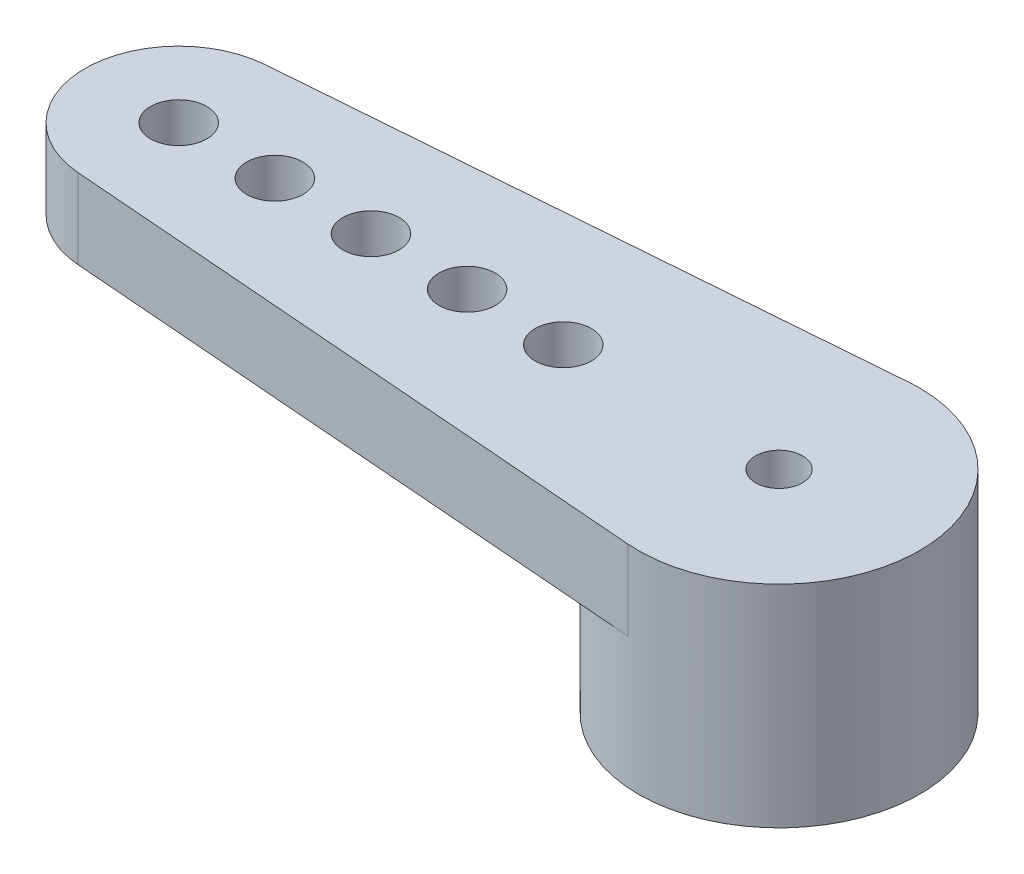
ISO-10303-21;
HEADER;
FILE_DESCRIPTION(('STEP AP214'),'2;1');
FILE_NAME('part.step','',(''),(''),'','','');
FILE_SCHEMA(('AUTOMOTIVE_DESIGN { 1 0 10303 214 1 1 1 1 }'));
ENDSEC;
DATA;
#1=APPLICATION_CONTEXT('core data for automotive mechanical design processes');
#2=APPLICATION_PROTOCOL_DEFINITION('international standard','automotive_design',2000,#1);
#3=PRODUCT_CONTEXT('',#1,'mechanical');
#4=PRODUCT('Part','Part','',(#3));
#5=PRODUCT_RELATED_PRODUCT_CATEGORY('part','',(#4));
#6=PRODUCT_DEFINITION_FORMATION('','',#4);
#7=PRODUCT_DEFINITION_CONTEXT('part definition',#1,'design');
#8=PRODUCT_DEFINITION('design','',#6,#7);
#9=PRODUCT_DEFINITION_SHAPE('','',#8);
#10=(LENGTH_UNIT() NAMED_UNIT(*) SI_UNIT(.MILLI.,.METRE.));
#11=(NAMED_UNIT(*) PLANE_ANGLE_UNIT() SI_UNIT($,.RADIAN.));
#12=(NAMED_UNIT(*) SI_UNIT($,.STERADIAN.) SOLID_ANGLE_UNIT());
#13=UNCERTAINTY_MEASURE_WITH_UNIT(LENGTH_MEASURE(1.E-05),#10,'distance_accuracy_value','');
#14=(GEOMETRIC_REPRESENTATION_CONTEXT(3) GLOBAL_UNCERTAINTY_ASSIGNED_CONTEXT((#13)) GLOBAL_UNIT_ASSIGNED_CONTEXT((#10,
#11,#12)) REPRESENTATION_CONTEXT('',''));
#15=CARTESIAN_POINT('',(0.,0.,0.));
#16=DIRECTION('',(0.,0.,1.));
#17=DIRECTION('',(1.,0.,0.));
#18=AXIS2_PLACEMENT_3D('',#15,#16,#17);
#19=CARTESIAN_POINT('',(0.,0.,0.));
#20=DIRECTION('',(0.,1.,0.));
#21=DIRECTION('',(0.,0.,1.));
#22=AXIS2_PLACEMENT_3D('',#19,#20,#21);
#23=PLANE('',#22);
#24=CARTESIAN_POINT('',(-4.6,0.,0.));
#25=DIRECTION('',(0.,1.,0.));
#26=DIRECTION('',(0.,0.,1.));
#27=AXIS2_PLACEMENT_3D('',#24,#25,#26);
#28=CIRCLE('',#27,0.6);
#29=CARTESIAN_POINT('',(-4.6,0.,0.6));
#30=VERTEX_POINT('',#29);
#31=EDGE_CURVE('E135',#30,#30,#28,.T.);
#32=ORIENTED_EDGE('',*,*,#31,.T.);
#33=EDGE_LOOP('',(#32));
#34=FACE_BOUND('',#33,.T.);
#35=CARTESIAN_POINT('',(-6.65,0.,0.));
#36=DIRECTION('',(0.,1.,0.));
#37=DIRECTION('',(0.,0.,1.));
#38=AXIS2_PLACEMENT_3D('',#35,#36,#37);
#39=CIRCLE('',#38,0.6);
#40=CARTESIAN_POINT('',(-6.65,0.,0.6));
#41=VERTEX_POINT('',#40);
#42=EDGE_CURVE('E143',#41,#41,#39,.T.);
#43=ORIENTED_EDGE('',*,*,#42,.T.);
#44=EDGE_LOOP('',(#43));
#45=FACE_BOUND('',#44,.T.);
#46=CARTESIAN_POINT('',(-8.7,0.,0.));
#47=DIRECTION('',(0.,1.,0.));
#48=DIRECTION('',(0.,0.,1.));
#49=AXIS2_PLACEMENT_3D('',#46,#47,#48);
#50=CIRCLE('',#49,0.6);
#51=CARTESIAN_POINT('',(-8.7,0.,0.6));
#52=VERTEX_POINT('',#51);
#53=EDGE_CURVE('E151',#52,#52,#50,.T.);
#54=ORIENTED_EDGE('',*,*,#53,.T.);
#55=EDGE_LOOP('',(#54));
#56=FACE_BOUND('',#55,.T.);
#57=CARTESIAN_POINT('',(-10.75,0.,0.));
#58=DIRECTION('',(0.,1.,0.));
#59=DIRECTION('',(0.,0.,1.));
#60=AXIS2_PLACEMENT_3D('',#57,#58,#59);
#61=CIRCLE('',#60,0.6);
#62=CARTESIAN_POINT('',(-10.75,0.,0.6));
#63=VERTEX_POINT('',#62);
#64=EDGE_CURVE('E159',#63,#63,#61,.T.);
#65=ORIENTED_EDGE('',*,*,#64,.T.);
#66=EDGE_LOOP('',(#65));
#67=FACE_BOUND('',#66,.T.);
#68=CARTESIAN_POINT('',(-12.8,0.,0.));
#69=DIRECTION('',(0.,1.,0.));
#70=DIRECTION('',(0.,0.,1.));
#71=AXIS2_PLACEMENT_3D('',#68,#69,#70);
#72=CIRCLE('',#71,0.6);
#73=CARTESIAN_POINT('',(-12.8,0.,0.6));
#74=VERTEX_POINT('',#73);
#75=EDGE_CURVE('E125',#74,#74,#72,.T.);
#76=ORIENTED_EDGE('',*,*,#75,.T.);
#77=EDGE_LOOP('',(#76));
#78=FACE_BOUND('',#77,.T.);
#79=CARTESIAN_POINT('',(0.,0.,0.));
#80=DIRECTION('',(0.,-1.,0.));
#81=DIRECTION('',(0.,0.,-1.));
#82=AXIS2_PLACEMENT_3D('',#79,#80,#81);
#83=CIRCLE('',#82,3.);
#84=CARTESIAN_POINT('',(-0.234375,0.,2.99083071392799));
#85=VERTEX_POINT('',#84);
#86=CARTESIAN_POINT('',(-0.234375,0.,-2.99083071392799));
#87=VERTEX_POINT('',#86);
#88=EDGE_CURVE('E95',#85,#87,#83,.T.);
#89=ORIENTED_EDGE('',*,*,#88,.F.);
#90=DIRECTION('',(0.99694357130933,0.,0.0781250000000001));
#91=VECTOR('',#90,1.);
#92=CARTESIAN_POINT('',(-0.234375,0.,2.99083071392799));
#93=LINE('',#92,#91);
#94=CARTESIAN_POINT('',(-12.95625,0.,1.99388714261866));
#95=VERTEX_POINT('',#94);
#96=EDGE_CURVE('E97',#95,#85,#93,.T.);
#97=ORIENTED_EDGE('',*,*,#96,.F.);
#98=CARTESIAN_POINT('',(-12.8,0.,0.));
#99=DIRECTION('',(0.,1.,0.));
#100=DIRECTION('',(0.,0.,1.));
#101=AXIS2_PLACEMENT_3D('',#98,#99,#100);
#102=CIRCLE('',#101,2.);
#103=CARTESIAN_POINT('',(-12.95625,0.,-1.99388714261866));
#104=VERTEX_POINT('',#103);
#105=EDGE_CURVE('E83',#104,#95,#102,.T.);
#106=ORIENTED_EDGE('',*,*,#105,.F.);
#107=DIRECTION('',(0.99694357130933,0.,-0.0781250000000001));
#108=VECTOR('',#107,1.);
#109=CARTESIAN_POINT('',(-0.234375,0.,-2.99083071392799));
#110=LINE('',#109,#108);
#111=EDGE_CURVE('E99',#104,#87,#110,.T.);
#112=ORIENTED_EDGE('',*,*,#111,.T.);
#113=EDGE_LOOP('',(#89,#97,#106,#112));
#114=FACE_BOUND('',#113,.T.);
#115=ADVANCED_FACE('F47',(#34,#45,#56,#67,#78,#114),#23,.F.);
#116=CARTESIAN_POINT('',(0.,1.7,0.));
#117=DIRECTION('',(0.,-1.,0.));
#118=DIRECTION('',(0.,0.,-1.));
#119=AXIS2_PLACEMENT_3D('',#116,#117,#118);
#120=CYLINDRICAL_SURFACE('',#119,3.);
#121=DIRECTION('',(0.,-1.,0.));
#122=VECTOR('',#121,1.);
#123=CARTESIAN_POINT('',(-0.234375,1.7,2.99083071392799));
#124=LINE('',#123,#122);
#125=CARTESIAN_POINT('',(-0.234375,1.7,2.99083071392799));
#126=VERTEX_POINT('',#125);
#127=EDGE_CURVE('E108',#126,#85,#124,.T.);
#128=ORIENTED_EDGE('',*,*,#127,.T.);
#129=ORIENTED_EDGE('',*,*,#88,.T.);
#130=DIRECTION('',(0.,-1.,0.));
#131=VECTOR('',#130,1.);
#132=CARTESIAN_POINT('',(-0.234375,1.7,-2.99083071392799));
#133=LINE('',#132,#131);
#134=CARTESIAN_POINT('',(-0.234375,1.7,-2.99083071392799));
#135=VERTEX_POINT('',#134);
#136=EDGE_CURVE('E11',#135,#87,#133,.T.);
#137=ORIENTED_EDGE('',*,*,#136,.F.);
#138=CARTESIAN_POINT('',(0.,1.7,0.));
#139=DIRECTION('',(0.,1.,0.));
#140=DIRECTION('',(0.,0.,1.));
#141=AXIS2_PLACEMENT_3D('',#138,#139,#140);
#142=CIRCLE('',#141,3.);
#143=EDGE_CURVE('E88',#126,#135,#142,.T.);
#144=ORIENTED_EDGE('',*,*,#143,.F.);
#145=EDGE_LOOP('',(#128,#129,#137,#144));
#146=FACE_BOUND('',#145,.T.);
#147=CARTESIAN_POINT('',(0.,-2.8,0.));
#148=DIRECTION('',(0.,-1.,0.));
#149=DIRECTION('',(0.,0.,-1.));
#150=AXIS2_PLACEMENT_3D('',#147,#148,#149);
#151=CIRCLE('',#150,3.);
#152=CARTESIAN_POINT('',(0.,-2.8,-3.));
#153=VERTEX_POINT('',#152);
#154=EDGE_CURVE('E103',#153,#153,#151,.T.);
#155=ORIENTED_EDGE('',*,*,#154,.F.);
#156=EDGE_LOOP('',(#155));
#157=FACE_BOUND('',#156,.T.);
#158=ADVANCED_FACE('F49',(#146,#157),#120,.T.);
#159=CARTESIAN_POINT('',(-0.234375,1.7,-2.99083071392799));
#160=DIRECTION('',(-0.0781250000000001,0.,-0.99694357130933));
#161=DIRECTION('',(-0.99694357130933,0.,0.0781250000000001));
#162=AXIS2_PLACEMENT_3D('',#159,#160,#161);
#163=PLANE('',#162);
#164=ORIENTED_EDGE('',*,*,#111,.F.);
#165=DIRECTION('',(0.,-1.,0.));
#166=VECTOR('',#165,1.);
#167=CARTESIAN_POINT('',(-12.95625,1.7,-1.99388714261866));
#168=LINE('',#167,#166);
#169=CARTESIAN_POINT('',(-12.95625,1.7,-1.99388714261866));
#170=VERTEX_POINT('',#169);
#171=EDGE_CURVE('E57',#170,#104,#168,.T.);
#172=ORIENTED_EDGE('',*,*,#171,.F.);
#173=DIRECTION('',(0.99694357130933,0.,-0.0781250000000001));
#174=VECTOR('',#173,1.);
#175=CARTESIAN_POINT('',(-0.234375,1.7,-2.99083071392799));
#176=LINE('',#175,#174);
#177=EDGE_CURVE('E129',#170,#135,#176,.T.);
#178=ORIENTED_EDGE('',*,*,#177,.T.);
#179=ORIENTED_EDGE('',*,*,#136,.T.);
#180=EDGE_LOOP('',(#164,#172,#178,#179));
#181=FACE_BOUND('',#180,.T.);
#182=ADVANCED_FACE('F201',(#181),#163,.T.);
#183=CARTESIAN_POINT('',(-12.8,1.7,0.));
#184=DIRECTION('',(0.,-1.,0.));
#185=DIRECTION('',(0.,0.,-1.));
#186=AXIS2_PLACEMENT_3D('',#183,#184,#185);
#187=CYLINDRICAL_SURFACE('',#186,2.);
#188=ORIENTED_EDGE('',*,*,#105,.T.);
#189=DIRECTION('',(0.,-1.,0.));
#190=VECTOR('',#189,1.);
#191=CARTESIAN_POINT('',(-12.95625,1.7,1.99388714261866));
#192=LINE('',#191,#190);
#193=CARTESIAN_POINT('',(-12.95625,1.7,1.99388714261866));
#194=VERTEX_POINT('',#193);
#195=EDGE_CURVE('E109',#194,#95,#192,.T.);
#196=ORIENTED_EDGE('',*,*,#195,.F.);
#197=CARTESIAN_POINT('',(-12.8,1.7,0.));
#198=DIRECTION('',(0.,1.,0.));
#199=DIRECTION('',(0.,0.,1.));
#200=AXIS2_PLACEMENT_3D('',#197,#198,#199);
#201=CIRCLE('',#200,2.);
#202=EDGE_CURVE('E118',#170,#194,#201,.T.);
#203=ORIENTED_EDGE('',*,*,#202,.F.);
#204=ORIENTED_EDGE('',*,*,#171,.T.);
#205=EDGE_LOOP('',(#188,#196,#203,#204));
#206=FACE_BOUND('',#205,.T.);
#207=ADVANCED_FACE('F206',(#206),#187,.T.);
#208=CARTESIAN_POINT('',(-0.234375,1.7,2.99083071392799));
#209=DIRECTION('',(0.0781250000000001,0.,-0.99694357130933));
#210=DIRECTION('',(-0.99694357130933,0.,-0.0781250000000001));
#211=AXIS2_PLACEMENT_3D('',#208,#209,#210);
#212=PLANE('',#211);
#213=ORIENTED_EDGE('',*,*,#96,.T.);
#214=ORIENTED_EDGE('',*,*,#127,.F.);
#215=DIRECTION('',(0.99694357130933,0.,0.0781250000000001));
#216=VECTOR('',#215,1.);
#217=CARTESIAN_POINT('',(-0.234375,1.7,2.99083071392799));
#218=LINE('',#217,#216);
#219=EDGE_CURVE('E65',#194,#126,#218,.T.);
#220=ORIENTED_EDGE('',*,*,#219,.F.);
#221=ORIENTED_EDGE('',*,*,#195,.T.);
#222=EDGE_LOOP('',(#213,#214,#220,#221));
#223=FACE_BOUND('',#222,.T.);
#224=ADVANCED_FACE('F107',(#223),#212,.F.);
#225=CARTESIAN_POINT('',(0.,1.7,0.));
#226=DIRECTION('',(0.,1.,0.));
#227=DIRECTION('',(0.,0.,1.));
#228=AXIS2_PLACEMENT_3D('',#225,#226,#227);
#229=PLANE('',#228);
#230=CARTESIAN_POINT('',(0.,1.7,0.));
#231=DIRECTION('',(0.,-1.,0.));
#232=DIRECTION('',(0.,0.,-1.));
#233=AXIS2_PLACEMENT_3D('',#230,#231,#232);
#234=CIRCLE('',#233,0.5);
#235=CARTESIAN_POINT('',(0.,1.7,-0.5));
#236=VERTEX_POINT('',#235);
#237=EDGE_CURVE('E104',#236,#236,#234,.T.);
#238=ORIENTED_EDGE('',*,*,#237,.T.);
#239=EDGE_LOOP('',(#238));
#240=FACE_BOUND('',#239,.T.);
#241=CARTESIAN_POINT('',(-12.8,1.7,0.));
#242=DIRECTION('',(0.,1.,0.));
#243=DIRECTION('',(0.,0.,1.));
#244=AXIS2_PLACEMENT_3D('',#241,#242,#243);
#245=CIRCLE('',#244,0.6);
#246=CARTESIAN_POINT('',(-12.8,1.7,0.6));
#247=VERTEX_POINT('',#246);
#248=EDGE_CURVE('E167',#247,#247,#245,.T.);
#249=ORIENTED_EDGE('',*,*,#248,.F.);
#250=EDGE_LOOP('',(#249));
#251=FACE_BOUND('',#250,.T.);
#252=CARTESIAN_POINT('',(-10.75,1.7,0.));
#253=DIRECTION('',(0.,1.,0.));
#254=DIRECTION('',(0.,0.,1.));
#255=AXIS2_PLACEMENT_3D('',#252,#253,#254);
#256=CIRCLE('',#255,0.6);
#257=CARTESIAN_POINT('',(-10.75,1.7,0.6));
#258=VERTEX_POINT('',#257);
#259=EDGE_CURVE('E163',#258,#258,#256,.T.);
#260=ORIENTED_EDGE('',*,*,#259,.F.);
#261=EDGE_LOOP('',(#260));
#262=FACE_BOUND('',#261,.T.);
#263=CARTESIAN_POINT('',(-8.7,1.7,0.));
#264=DIRECTION('',(0.,1.,0.));
#265=DIRECTION('',(0.,0.,1.));
#266=AXIS2_PLACEMENT_3D('',#263,#264,#265);
#267=CIRCLE('',#266,0.6);
#268=CARTESIAN_POINT('',(-8.7,1.7,0.6));
#269=VERTEX_POINT('',#268);
#270=EDGE_CURVE('E155',#269,#269,#267,.T.);
#271=ORIENTED_EDGE('',*,*,#270,.F.);
#272=EDGE_LOOP('',(#271));
#273=FACE_BOUND('',#272,.T.);
#274=CARTESIAN_POINT('',(-6.65,1.7,0.));
#275=DIRECTION('',(0.,1.,0.));
#276=DIRECTION('',(0.,0.,1.));
#277=AXIS2_PLACEMENT_3D('',#274,#275,#276);
#278=CIRCLE('',#277,0.6);
#279=CARTESIAN_POINT('',(-6.65,1.7,0.6));
#280=VERTEX_POINT('',#279);
#281=EDGE_CURVE('E147',#280,#280,#278,.T.);
#282=ORIENTED_EDGE('',*,*,#281,.F.);
#283=EDGE_LOOP('',(#282));
#284=FACE_BOUND('',#283,.T.);
#285=CARTESIAN_POINT('',(-4.6,1.7,0.));
#286=DIRECTION('',(0.,1.,0.));
#287=DIRECTION('',(0.,0.,1.));
#288=AXIS2_PLACEMENT_3D('',#285,#286,#287);
#289=CIRCLE('',#288,0.6);
#290=CARTESIAN_POINT('',(-4.6,1.7,0.6));
#291=VERTEX_POINT('',#290);
#292=EDGE_CURVE('E139',#291,#291,#289,.T.);
#293=ORIENTED_EDGE('',*,*,#292,.F.);
#294=EDGE_LOOP('',(#293));
#295=FACE_BOUND('',#294,.T.);
#296=ORIENTED_EDGE('',*,*,#143,.T.);
#297=ORIENTED_EDGE('',*,*,#177,.F.);
#298=ORIENTED_EDGE('',*,*,#202,.T.);
#299=ORIENTED_EDGE('',*,*,#219,.T.);
#300=EDGE_LOOP('',(#296,#297,#298,#299));
#301=FACE_BOUND('',#300,.T.);
#302=ADVANCED_FACE('F185',(#240,#251,#262,#273,#284,#295,#301),#229,.T.);
#303=CARTESIAN_POINT('',(-4.6,0.,0.));
#304=DIRECTION('',(0.,1.,0.));
#305=DIRECTION('',(0.,0.,1.));
#306=AXIS2_PLACEMENT_3D('',#303,#304,#305);
#307=CYLINDRICAL_SURFACE('',#306,0.6);
#308=ORIENTED_EDGE('',*,*,#31,.F.);
#309=EDGE_LOOP('',(#308));
#310=FACE_BOUND('',#309,.T.);
#311=ORIENTED_EDGE('',*,*,#292,.T.);
#312=EDGE_LOOP('',(#311));
#313=FACE_BOUND('',#312,.T.);
#314=ADVANCED_FACE('F228',(#310,#313),#307,.F.);
#315=CARTESIAN_POINT('',(-6.65,0.,0.));
#316=DIRECTION('',(0.,1.,0.));
#317=DIRECTION('',(0.,0.,1.));
#318=AXIS2_PLACEMENT_3D('',#315,#316,#317);
#319=CYLINDRICAL_SURFACE('',#318,0.6);
#320=ORIENTED_EDGE('',*,*,#42,.F.);
#321=EDGE_LOOP('',(#320));
#322=FACE_BOUND('',#321,.T.);
#323=ORIENTED_EDGE('',*,*,#281,.T.);
#324=EDGE_LOOP('',(#323));
#325=FACE_BOUND('',#324,.T.);
#326=ADVANCED_FACE('F232',(#322,#325),#319,.F.);
#327=CARTESIAN_POINT('',(-8.7,0.,0.));
#328=DIRECTION('',(0.,1.,0.));
#329=DIRECTION('',(0.,0.,1.));
#330=AXIS2_PLACEMENT_3D('',#327,#328,#329);
#331=CYLINDRICAL_SURFACE('',#330,0.6);
#332=ORIENTED_EDGE('',*,*,#53,.F.);
#333=EDGE_LOOP('',(#332));
#334=FACE_BOUND('',#333,.T.);
#335=ORIENTED_EDGE('',*,*,#270,.T.);
#336=EDGE_LOOP('',(#335));
#337=FACE_BOUND('',#336,.T.);
#338=ADVANCED_FACE('F241',(#334,#337),#331,.F.);
#339=CARTESIAN_POINT('',(-10.75,0.,0.));
#340=DIRECTION('',(0.,1.,0.));
#341=DIRECTION('',(0.,0.,1.));
#342=AXIS2_PLACEMENT_3D('',#339,#340,#341);
#343=CYLINDRICAL_SURFACE('',#342,0.6);
#344=ORIENTED_EDGE('',*,*,#64,.F.);
#345=EDGE_LOOP('',(#344));
#346=FACE_BOUND('',#345,.T.);
#347=ORIENTED_EDGE('',*,*,#259,.T.);
#348=EDGE_LOOP('',(#347));
#349=FACE_BOUND('',#348,.T.);
#350=ADVANCED_FACE('F250',(#346,#349),#343,.F.);
#351=CARTESIAN_POINT('',(-12.8,0.,0.));
#352=DIRECTION('',(0.,1.,0.));
#353=DIRECTION('',(0.,0.,1.));
#354=AXIS2_PLACEMENT_3D('',#351,#352,#353);
#355=CYLINDRICAL_SURFACE('',#354,0.6);
#356=ORIENTED_EDGE('',*,*,#75,.F.);
#357=EDGE_LOOP('',(#356));
#358=FACE_BOUND('',#357,.T.);
#359=ORIENTED_EDGE('',*,*,#248,.T.);
#360=EDGE_LOOP('',(#359));
#361=FACE_BOUND('',#360,.T.);
#362=ADVANCED_FACE('F197',(#358,#361),#355,.F.);
#363=CARTESIAN_POINT('',(0.,-2.8,0.));
#364=DIRECTION('',(0.,-1.,0.));
#365=DIRECTION('',(0.,0.,-1.));
#366=AXIS2_PLACEMENT_3D('',#363,#364,#365);
#367=PLANE('',#366);
#368=CARTESIAN_POINT('',(0.,-2.8,0.));
#369=DIRECTION('',(0.,-1.,0.));
#370=DIRECTION('',(0.,0.,-1.));
#371=AXIS2_PLACEMENT_3D('',#368,#369,#370);
#372=CIRCLE('',#371,0.5);
#373=CARTESIAN_POINT('',(0.,-2.8,-0.5));
#374=VERTEX_POINT('',#373);
#375=EDGE_CURVE('E177',#374,#374,#372,.T.);
#376=ORIENTED_EDGE('',*,*,#375,.F.);
#377=EDGE_LOOP('',(#376));
#378=FACE_BOUND('',#377,.T.);
#379=ORIENTED_EDGE('',*,*,#154,.T.);
#380=EDGE_LOOP('',(#379));
#381=FACE_BOUND('',#380,.T.);
#382=ADVANCED_FACE('F191',(#378,#381),#367,.T.);
#383=CARTESIAN_POINT('',(0.,1.7,0.));
#384=DIRECTION('',(0.,-1.,0.));
#385=DIRECTION('',(0.,0.,-1.));
#386=AXIS2_PLACEMENT_3D('',#383,#384,#385);
#387=CYLINDRICAL_SURFACE('',#386,0.5);
#388=ORIENTED_EDGE('',*,*,#237,.F.);
#389=EDGE_LOOP('',(#388));
#390=FACE_BOUND('',#389,.T.);
#391=ORIENTED_EDGE('',*,*,#375,.T.);
#392=EDGE_LOOP('',(#391));
#393=FACE_BOUND('',#392,.T.);
#394=ADVANCED_FACE('F188',(#390,#393),#387,.F.);
#395=CLOSED_SHELL('',(#115,#158,#182,#207,#224,#302,#314,#326,#338,#350,#362,#382,#394));
#396=MANIFOLD_SOLID_BREP('B2',#395);
#397=ADVANCED_BREP_SHAPE_REPRESENTATION('',(#18,#396),#14);
#398=SHAPE_DEFINITION_REPRESENTATION(#9,#397);
ENDSEC;
END-ISO-10303-21;
